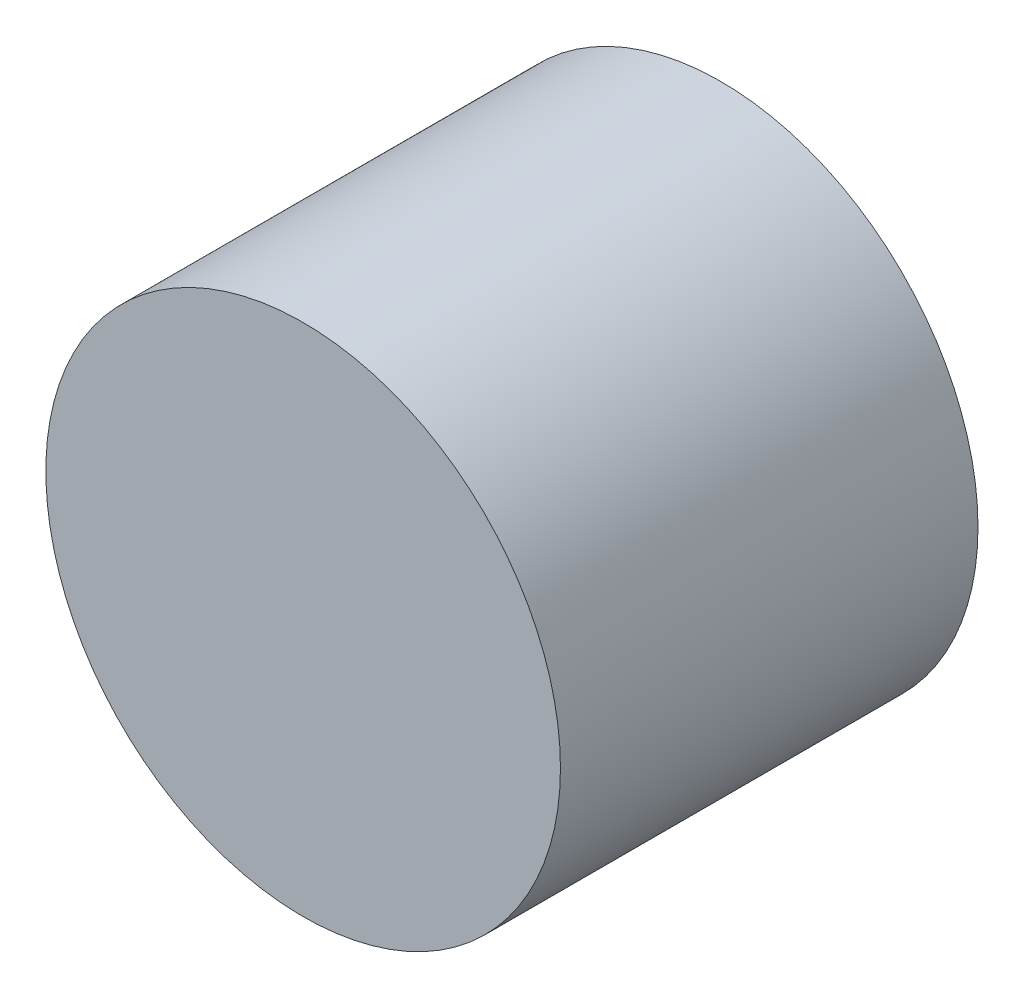
ISO-10303-21;
HEADER;
FILE_DESCRIPTION(('STEP AP214'),'2;1');
FILE_NAME('part.step','',(''),(''),'','','');
FILE_SCHEMA(('AUTOMOTIVE_DESIGN { 1 0 10303 214 1 1 1 1 }'));
ENDSEC;
DATA;
#1=APPLICATION_CONTEXT('core data for automotive mechanical design processes');
#2=APPLICATION_PROTOCOL_DEFINITION('international standard','automotive_design',2000,#1);
#3=PRODUCT_CONTEXT('',#1,'mechanical');
#4=PRODUCT('Part','Part','',(#3));
#5=PRODUCT_RELATED_PRODUCT_CATEGORY('part','',(#4));
#6=PRODUCT_DEFINITION_FORMATION('','',#4);
#7=PRODUCT_DEFINITION_CONTEXT('part definition',#1,'design');
#8=PRODUCT_DEFINITION('design','',#6,#7);
#9=PRODUCT_DEFINITION_SHAPE('','',#8);
#10=(LENGTH_UNIT() NAMED_UNIT(*) SI_UNIT(.MILLI.,.METRE.));
#11=(NAMED_UNIT(*) PLANE_ANGLE_UNIT() SI_UNIT($,.RADIAN.));
#12=(NAMED_UNIT(*) SI_UNIT($,.STERADIAN.) SOLID_ANGLE_UNIT());
#13=UNCERTAINTY_MEASURE_WITH_UNIT(LENGTH_MEASURE(1.E-05),#10,'distance_accuracy_value','');
#14=(GEOMETRIC_REPRESENTATION_CONTEXT(3) GLOBAL_UNCERTAINTY_ASSIGNED_CONTEXT((#13)) GLOBAL_UNIT_ASSIGNED_CONTEXT((#10,
#11,#12)) REPRESENTATION_CONTEXT('',''));
#15=CARTESIAN_POINT('',(0.,0.,0.));
#16=DIRECTION('',(0.,0.,1.));
#17=DIRECTION('',(1.,0.,0.));
#18=AXIS2_PLACEMENT_3D('',#15,#16,#17);
#19=CARTESIAN_POINT('',(-17.516225753918,20.5984900464398,2.));
#20=DIRECTION('',(0.,0.,-1.));
#21=DIRECTION('',(-1.,0.,0.));
#22=AXIS2_PLACEMENT_3D('',#19,#20,#21);
#23=CYLINDRICAL_SURFACE('',#22,1.2325100439821);
#24=CARTESIAN_POINT('',(-17.516225753918,20.5984900464398,2.));
#25=DIRECTION('',(0.,0.,1.));
#26=DIRECTION('',(1.,0.,0.));
#27=AXIS2_PLACEMENT_3D('',#24,#25,#26);
#28=CIRCLE('',#27,1.2325100439821);
#29=CARTESIAN_POINT('',(-16.2837157099359,20.5984900464398,2.));
#30=VERTEX_POINT('',#29);
#31=EDGE_CURVE('E10',#30,#30,#28,.T.);
#32=ORIENTED_EDGE('',*,*,#31,.F.);
#33=EDGE_LOOP('',(#32));
#34=FACE_BOUND('',#33,.T.);
#35=CARTESIAN_POINT('',(-17.516225753918,20.5984900464398,0.));
#36=DIRECTION('',(0.,0.,1.));
#37=DIRECTION('',(1.,0.,0.));
#38=AXIS2_PLACEMENT_3D('',#35,#36,#37);
#39=CIRCLE('',#38,1.2325100439821);
#40=CARTESIAN_POINT('',(-16.2837157099359,20.5984900464398,0.));
#41=VERTEX_POINT('',#40);
#42=EDGE_CURVE('E38',#41,#41,#39,.T.);
#43=ORIENTED_EDGE('',*,*,#42,.T.);
#44=EDGE_LOOP('',(#43));
#45=FACE_BOUND('',#44,.T.);
#46=ADVANCED_FACE('F35',(#34,#45),#23,.T.);
#47=CARTESIAN_POINT('',(-17.516225753918,20.5984900464398,2.));
#48=DIRECTION('',(0.,0.,1.));
#49=DIRECTION('',(1.,0.,0.));
#50=AXIS2_PLACEMENT_3D('',#47,#48,#49);
#51=PLANE('',#50);
#52=ORIENTED_EDGE('',*,*,#31,.T.);
#53=EDGE_LOOP('',(#52));
#54=FACE_BOUND('',#53,.T.);
#55=ADVANCED_FACE('F50',(#54),#51,.T.);
#56=CARTESIAN_POINT('',(-17.516225753918,20.5984900464398,0.));
#57=DIRECTION('',(0.,0.,1.));
#58=DIRECTION('',(1.,0.,0.));
#59=AXIS2_PLACEMENT_3D('',#56,#57,#58);
#60=PLANE('',#59);
#61=ORIENTED_EDGE('',*,*,#42,.F.);
#62=EDGE_LOOP('',(#61));
#63=FACE_BOUND('',#62,.T.);
#64=ADVANCED_FACE('F48',(#63),#60,.F.);
#65=CLOSED_SHELL('',(#46,#55,#64));
#66=MANIFOLD_SOLID_BREP('B2',#65);
#67=ADVANCED_BREP_SHAPE_REPRESENTATION('',(#18,#66),#14);
#68=SHAPE_DEFINITION_REPRESENTATION(#9,#67);
ENDSEC;
END-ISO-10303-21;
